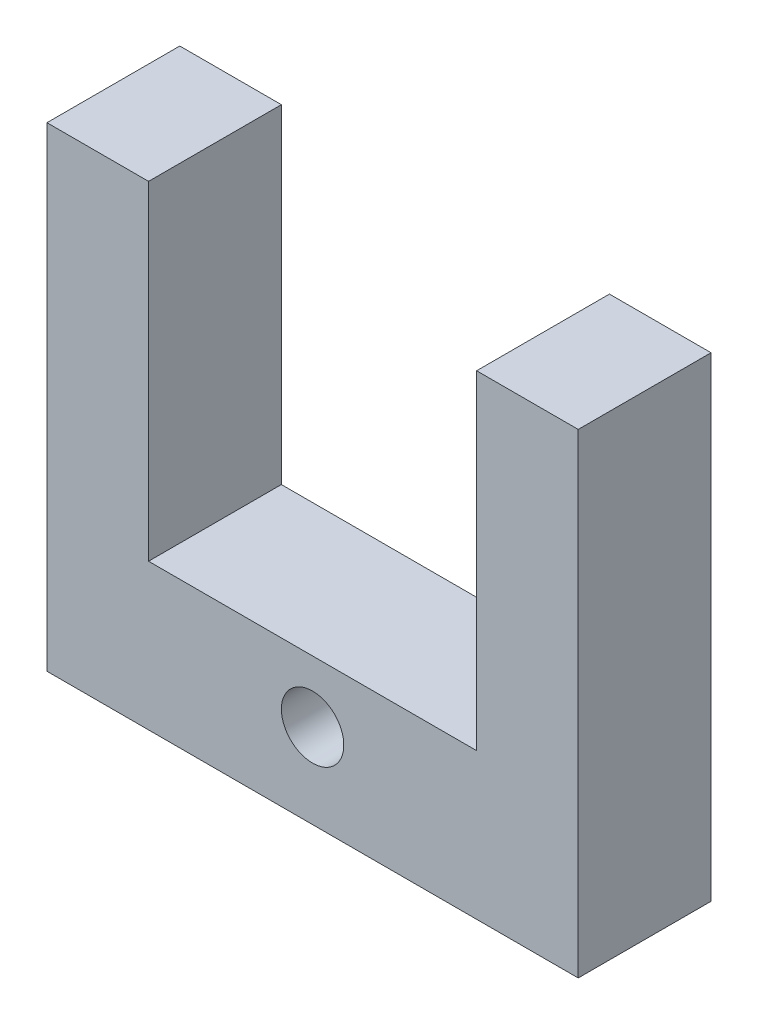
ISO-10303-21;
HEADER;
FILE_DESCRIPTION(('STEP AP214'),'2;1');
FILE_NAME('part.step','',(''),(''),'','','');
FILE_SCHEMA(('AUTOMOTIVE_DESIGN { 1 0 10303 214 1 1 1 1 }'));
ENDSEC;
DATA;
#1=APPLICATION_CONTEXT('core data for automotive mechanical design processes');
#2=APPLICATION_PROTOCOL_DEFINITION('international standard','automotive_design',2000,#1);
#3=PRODUCT_CONTEXT('',#1,'mechanical');
#4=PRODUCT('Part','Part','',(#3));
#5=PRODUCT_RELATED_PRODUCT_CATEGORY('part','',(#4));
#6=PRODUCT_DEFINITION_FORMATION('','',#4);
#7=PRODUCT_DEFINITION_CONTEXT('part definition',#1,'design');
#8=PRODUCT_DEFINITION('design','',#6,#7);
#9=PRODUCT_DEFINITION_SHAPE('','',#8);
#10=(LENGTH_UNIT() NAMED_UNIT(*) SI_UNIT(.MILLI.,.METRE.));
#11=(NAMED_UNIT(*) PLANE_ANGLE_UNIT() SI_UNIT($,.RADIAN.));
#12=(NAMED_UNIT(*) SI_UNIT($,.STERADIAN.) SOLID_ANGLE_UNIT());
#13=UNCERTAINTY_MEASURE_WITH_UNIT(LENGTH_MEASURE(1.E-05),#10,'distance_accuracy_value','');
#14=(GEOMETRIC_REPRESENTATION_CONTEXT(3) GLOBAL_UNCERTAINTY_ASSIGNED_CONTEXT((#13)) GLOBAL_UNIT_ASSIGNED_CONTEXT((#10,
#11,#12)) REPRESENTATION_CONTEXT('',''));
#15=CARTESIAN_POINT('',(0.,0.,0.));
#16=DIRECTION('',(0.,0.,1.));
#17=DIRECTION('',(1.,0.,0.));
#18=AXIS2_PLACEMENT_3D('',#15,#16,#17);
#19=CARTESIAN_POINT('',(9.99999999999999,35.,5.));
#20=DIRECTION('',(-1.,0.,0.));
#21=DIRECTION('',(0.,-1.,0.));
#22=AXIS2_PLACEMENT_3D('',#19,#20,#21);
#23=PLANE('',#22);
#24=DIRECTION('',(0.,1.,0.));
#25=VECTOR('',#24,1.);
#26=CARTESIAN_POINT('',(9.99999999999999,35.,0.));
#27=LINE('',#26,#25);
#28=CARTESIAN_POINT('',(10.,-35.,0.));
#29=VERTEX_POINT('',#28);
#30=CARTESIAN_POINT('',(10.,-17.1146771652388,0.));
#31=VERTEX_POINT('',#30);
#32=EDGE_CURVE('E141',#29,#31,#27,.T.);
#33=ORIENTED_EDGE('',*,*,#32,.T.);
#34=DIRECTION('',(0.,0.,1.));
#35=VECTOR('',#34,1.);
#36=CARTESIAN_POINT('',(10.,-17.1146771652388,-5.));
#37=LINE('',#36,#35);
#38=CARTESIAN_POINT('',(10.,-17.1146771652388,5.));
#39=VERTEX_POINT('',#38);
#40=EDGE_CURVE('E166',#31,#39,#37,.T.);
#41=ORIENTED_EDGE('',*,*,#40,.T.);
#42=DIRECTION('',(0.,1.,0.));
#43=VECTOR('',#42,1.);
#44=CARTESIAN_POINT('',(9.99999999999999,35.,5.));
#45=LINE('',#44,#43);
#46=CARTESIAN_POINT('',(10.,-35.,5.));
#47=VERTEX_POINT('',#46);
#48=EDGE_CURVE('E133',#47,#39,#45,.T.);
#49=ORIENTED_EDGE('',*,*,#48,.F.);
#50=DIRECTION('',(0.,0.,-1.));
#51=VECTOR('',#50,1.);
#52=CARTESIAN_POINT('',(10.,-35.,5.));
#53=LINE('',#52,#51);
#54=EDGE_CURVE('E55',#47,#29,#53,.T.);
#55=ORIENTED_EDGE('',*,*,#54,.T.);
#56=EDGE_LOOP('',(#33,#41,#49,#55));
#57=FACE_BOUND('',#56,.T.);
#58=ADVANCED_FACE('F48',(#57),#23,.F.);
#59=CARTESIAN_POINT('',(-10.,35.,5.));
#60=DIRECTION('',(1.,0.,0.));
#61=DIRECTION('',(0.,1.,0.));
#62=AXIS2_PLACEMENT_3D('',#59,#60,#61);
#63=PLANE('',#62);
#64=DIRECTION('',(0.,-1.,0.));
#65=VECTOR('',#64,1.);
#66=CARTESIAN_POINT('',(-10.,35.,5.));
#67=LINE('',#66,#65);
#68=CARTESIAN_POINT('',(-10.,-17.1146771652388,5.));
#69=VERTEX_POINT('',#68);
#70=CARTESIAN_POINT('',(-10.,-35.,5.));
#71=VERTEX_POINT('',#70);
#72=EDGE_CURVE('E125',#69,#71,#67,.T.);
#73=ORIENTED_EDGE('',*,*,#72,.F.);
#74=DIRECTION('',(0.,0.,1.));
#75=VECTOR('',#74,1.);
#76=CARTESIAN_POINT('',(-10.,-17.1146771652388,-5.));
#77=LINE('',#76,#75);
#78=CARTESIAN_POINT('',(-10.,-17.1146771652388,0.));
#79=VERTEX_POINT('',#78);
#80=EDGE_CURVE('E110',#79,#69,#77,.T.);
#81=ORIENTED_EDGE('',*,*,#80,.F.);
#82=DIRECTION('',(0.,-1.,0.));
#83=VECTOR('',#82,1.);
#84=CARTESIAN_POINT('',(-10.,35.,0.));
#85=LINE('',#84,#83);
#86=CARTESIAN_POINT('',(-10.,-35.,0.));
#87=VERTEX_POINT('',#86);
#88=EDGE_CURVE('E144',#79,#87,#85,.T.);
#89=ORIENTED_EDGE('',*,*,#88,.T.);
#90=DIRECTION('',(0.,0.,-1.));
#91=VECTOR('',#90,1.);
#92=CARTESIAN_POINT('',(-10.,-35.,5.));
#93=LINE('',#92,#91);
#94=EDGE_CURVE('E12',#71,#87,#93,.T.);
#95=ORIENTED_EDGE('',*,*,#94,.F.);
#96=EDGE_LOOP('',(#73,#81,#89,#95));
#97=FACE_BOUND('',#96,.T.);
#98=ADVANCED_FACE('F130',(#97),#63,.F.);
#99=CARTESIAN_POINT('',(-10.,-35.,5.));
#100=DIRECTION('',(0.,1.,0.));
#101=DIRECTION('',(0.,0.,1.));
#102=AXIS2_PLACEMENT_3D('',#99,#100,#101);
#103=PLANE('',#102);
#104=DIRECTION('',(1.,0.,0.));
#105=VECTOR('',#104,1.);
#106=CARTESIAN_POINT('',(-10.,-35.,0.));
#107=LINE('',#106,#105);
#108=EDGE_CURVE('E137',#87,#29,#107,.T.);
#109=ORIENTED_EDGE('',*,*,#108,.T.);
#110=ORIENTED_EDGE('',*,*,#54,.F.);
#111=DIRECTION('',(1.,0.,0.));
#112=VECTOR('',#111,1.);
#113=CARTESIAN_POINT('',(-10.,-35.,5.));
#114=LINE('',#113,#112);
#115=EDGE_CURVE('E132',#71,#47,#114,.T.);
#116=ORIENTED_EDGE('',*,*,#115,.F.);
#117=ORIENTED_EDGE('',*,*,#94,.T.);
#118=EDGE_LOOP('',(#109,#110,#116,#117));
#119=FACE_BOUND('',#118,.T.);
#120=ADVANCED_FACE('F199',(#119),#103,.F.);
#121=CARTESIAN_POINT('',(0.,0.,5.));
#122=DIRECTION('',(0.,0.,1.));
#123=DIRECTION('',(1.,0.,0.));
#124=AXIS2_PLACEMENT_3D('',#121,#122,#123);
#125=PLANE('',#124);
#126=DIRECTION('',(1.,0.,0.));
#127=VECTOR('',#126,1.);
#128=CARTESIAN_POINT('',(0.,-17.1146771652388,5.));
#129=LINE('',#128,#127);
#130=CARTESIAN_POINT('',(6.175,-17.1146771652388,5.));
#131=VERTEX_POINT('',#130);
#132=EDGE_CURVE('E118',#131,#39,#129,.T.);
#133=ORIENTED_EDGE('',*,*,#132,.F.);
#134=DIRECTION('',(0.,1.,0.));
#135=VECTOR('',#134,1.);
#136=CARTESIAN_POINT('',(6.175,-6.49999999999998,5.));
#137=LINE('',#136,#135);
#138=CARTESIAN_POINT('',(6.175,-29.5,5.));
#139=VERTEX_POINT('',#138);
#140=EDGE_CURVE('E170',#139,#131,#137,.T.);
#141=ORIENTED_EDGE('',*,*,#140,.F.);
#142=DIRECTION('',(1.,0.,0.));
#143=VECTOR('',#142,1.);
#144=CARTESIAN_POINT('',(-6.175,-29.5,5.));
#145=LINE('',#144,#143);
#146=CARTESIAN_POINT('',(-6.175,-29.5,5.));
#147=VERTEX_POINT('',#146);
#148=EDGE_CURVE('E174',#147,#139,#145,.T.);
#149=ORIENTED_EDGE('',*,*,#148,.F.);
#150=DIRECTION('',(0.,-1.,0.));
#151=VECTOR('',#150,1.);
#152=CARTESIAN_POINT('',(-6.175,-6.49999999999998,5.));
#153=LINE('',#152,#151);
#154=CARTESIAN_POINT('',(-6.175,-17.1146771652388,5.));
#155=VERTEX_POINT('',#154);
#156=EDGE_CURVE('E128',#155,#147,#153,.T.);
#157=ORIENTED_EDGE('',*,*,#156,.F.);
#158=EDGE_CURVE('E70',#69,#155,#129,.T.);
#159=ORIENTED_EDGE('',*,*,#158,.F.);
#160=ORIENTED_EDGE('',*,*,#72,.T.);
#161=ORIENTED_EDGE('',*,*,#115,.T.);
#162=ORIENTED_EDGE('',*,*,#48,.T.);
#163=EDGE_LOOP('',(#133,#141,#149,#157,#159,#160,#161,#162));
#164=FACE_BOUND('',#163,.T.);
#165=CARTESIAN_POINT('',(0.,-31.82,5.));
#166=DIRECTION('',(0.,0.,1.));
#167=DIRECTION('',(-1.,0.,0.));
#168=AXIS2_PLACEMENT_3D('',#165,#166,#167);
#169=CIRCLE('',#168,1.175);
#170=CARTESIAN_POINT('',(-1.175,-31.82,5.));
#171=VERTEX_POINT('',#170);
#172=EDGE_CURVE('E161',#171,#171,#169,.T.);
#173=ORIENTED_EDGE('',*,*,#172,.F.);
#174=EDGE_LOOP('',(#173));
#175=FACE_BOUND('',#174,.T.);
#176=ADVANCED_FACE('F123',(#164,#175),#125,.T.);
#177=CARTESIAN_POINT('',(0.,0.,0.));
#178=DIRECTION('',(0.,0.,1.));
#179=DIRECTION('',(1.,0.,0.));
#180=AXIS2_PLACEMENT_3D('',#177,#178,#179);
#181=PLANE('',#180);
#182=CARTESIAN_POINT('',(0.,-31.82,0.));
#183=DIRECTION('',(0.,0.,1.));
#184=DIRECTION('',(-1.,0.,0.));
#185=AXIS2_PLACEMENT_3D('',#182,#183,#184);
#186=CIRCLE('',#185,1.175);
#187=CARTESIAN_POINT('',(-1.175,-31.82,0.));
#188=VERTEX_POINT('',#187);
#189=EDGE_CURVE('E164',#188,#188,#186,.T.);
#190=ORIENTED_EDGE('',*,*,#189,.T.);
#191=EDGE_LOOP('',(#190));
#192=FACE_BOUND('',#191,.T.);
#193=DIRECTION('',(0.,1.,0.));
#194=VECTOR('',#193,1.);
#195=CARTESIAN_POINT('',(6.175,-6.49999999999998,0.));
#196=LINE('',#195,#194);
#197=CARTESIAN_POINT('',(6.175,-29.5,0.));
#198=VERTEX_POINT('',#197);
#199=CARTESIAN_POINT('',(6.175,-17.1146771652388,0.));
#200=VERTEX_POINT('',#199);
#201=EDGE_CURVE('E160',#198,#200,#196,.T.);
#202=ORIENTED_EDGE('',*,*,#201,.T.);
#203=DIRECTION('',(1.,0.,0.));
#204=VECTOR('',#203,1.);
#205=CARTESIAN_POINT('',(0.,-17.1146771652388,0.));
#206=LINE('',#205,#204);
#207=EDGE_CURVE('E62',#200,#31,#206,.T.);
#208=ORIENTED_EDGE('',*,*,#207,.T.);
#209=ORIENTED_EDGE('',*,*,#32,.F.);
#210=ORIENTED_EDGE('',*,*,#108,.F.);
#211=ORIENTED_EDGE('',*,*,#88,.F.);
#212=DIRECTION('',(1.,0.,0.));
#213=VECTOR('',#212,1.);
#214=CARTESIAN_POINT('',(0.,-17.1146771652388,0.));
#215=LINE('',#214,#213);
#216=CARTESIAN_POINT('',(-6.175,-17.1146771652388,0.));
#217=VERTEX_POINT('',#216);
#218=EDGE_CURVE('E113',#79,#217,#215,.T.);
#219=ORIENTED_EDGE('',*,*,#218,.T.);
#220=DIRECTION('',(0.,-1.,0.));
#221=VECTOR('',#220,1.);
#222=CARTESIAN_POINT('',(-6.175,-6.49999999999998,0.));
#223=LINE('',#222,#221);
#224=CARTESIAN_POINT('',(-6.175,-29.5,0.));
#225=VERTEX_POINT('',#224);
#226=EDGE_CURVE('E173',#217,#225,#223,.T.);
#227=ORIENTED_EDGE('',*,*,#226,.T.);
#228=DIRECTION('',(1.,0.,0.));
#229=VECTOR('',#228,1.);
#230=CARTESIAN_POINT('',(-6.175,-29.5,0.));
#231=LINE('',#230,#229);
#232=EDGE_CURVE('E176',#225,#198,#231,.T.);
#233=ORIENTED_EDGE('',*,*,#232,.T.);
#234=EDGE_LOOP('',(#202,#208,#209,#210,#211,#219,#227,#233));
#235=FACE_BOUND('',#234,.T.);
#236=ADVANCED_FACE('F157',(#192,#235),#181,.F.);
#237=CARTESIAN_POINT('',(6.175,-6.49999999999998,0.));
#238=DIRECTION('',(1.,0.,0.));
#239=DIRECTION('',(0.,1.,0.));
#240=AXIS2_PLACEMENT_3D('',#237,#238,#239);
#241=PLANE('',#240);
#242=ORIENTED_EDGE('',*,*,#140,.T.);
#243=DIRECTION('',(0.,0.,1.));
#244=VECTOR('',#243,1.);
#245=CARTESIAN_POINT('',(6.175,-17.1146771652388,-5.));
#246=LINE('',#245,#244);
#247=EDGE_CURVE('E194',#200,#131,#246,.T.);
#248=ORIENTED_EDGE('',*,*,#247,.F.);
#249=ORIENTED_EDGE('',*,*,#201,.F.);
#250=DIRECTION('',(0.,0.,1.));
#251=VECTOR('',#250,1.);
#252=CARTESIAN_POINT('',(6.175,-29.5,0.));
#253=LINE('',#252,#251);
#254=EDGE_CURVE('E145',#198,#139,#253,.T.);
#255=ORIENTED_EDGE('',*,*,#254,.T.);
#256=EDGE_LOOP('',(#242,#248,#249,#255));
#257=FACE_BOUND('',#256,.T.);
#258=ADVANCED_FACE('F193',(#257),#241,.F.);
#259=CARTESIAN_POINT('',(-6.175,-29.5,0.));
#260=DIRECTION('',(0.,-1.,0.));
#261=DIRECTION('',(0.,0.,-1.));
#262=AXIS2_PLACEMENT_3D('',#259,#260,#261);
#263=PLANE('',#262);
#264=ORIENTED_EDGE('',*,*,#148,.T.);
#265=ORIENTED_EDGE('',*,*,#254,.F.);
#266=ORIENTED_EDGE('',*,*,#232,.F.);
#267=DIRECTION('',(0.,0.,1.));
#268=VECTOR('',#267,1.);
#269=CARTESIAN_POINT('',(-6.175,-29.5,0.));
#270=LINE('',#269,#268);
#271=EDGE_CURVE('E178',#225,#147,#270,.T.);
#272=ORIENTED_EDGE('',*,*,#271,.T.);
#273=EDGE_LOOP('',(#264,#265,#266,#272));
#274=FACE_BOUND('',#273,.T.);
#275=ADVANCED_FACE('F188',(#274),#263,.F.);
#276=CARTESIAN_POINT('',(-6.175,-6.49999999999998,0.));
#277=DIRECTION('',(-1.,0.,0.));
#278=DIRECTION('',(0.,-1.,0.));
#279=AXIS2_PLACEMENT_3D('',#276,#277,#278);
#280=PLANE('',#279);
#281=ORIENTED_EDGE('',*,*,#226,.F.);
#282=DIRECTION('',(0.,0.,1.));
#283=VECTOR('',#282,1.);
#284=CARTESIAN_POINT('',(-6.175,-17.1146771652388,-5.));
#285=LINE('',#284,#283);
#286=EDGE_CURVE('E117',#217,#155,#285,.T.);
#287=ORIENTED_EDGE('',*,*,#286,.T.);
#288=ORIENTED_EDGE('',*,*,#156,.T.);
#289=ORIENTED_EDGE('',*,*,#271,.F.);
#290=EDGE_LOOP('',(#281,#287,#288,#289));
#291=FACE_BOUND('',#290,.T.);
#292=ADVANCED_FACE('F195',(#291),#280,.F.);
#293=CARTESIAN_POINT('',(0.,-31.82,0.));
#294=DIRECTION('',(0.,0.,1.));
#295=DIRECTION('',(1.,0.,0.));
#296=AXIS2_PLACEMENT_3D('',#293,#294,#295);
#297=CYLINDRICAL_SURFACE('',#296,1.175);
#298=ORIENTED_EDGE('',*,*,#189,.F.);
#299=EDGE_LOOP('',(#298));
#300=FACE_BOUND('',#299,.T.);
#301=ORIENTED_EDGE('',*,*,#172,.T.);
#302=EDGE_LOOP('',(#301));
#303=FACE_BOUND('',#302,.T.);
#304=ADVANCED_FACE('F250',(#300,#303),#297,.F.);
#305=CARTESIAN_POINT('',(0.,-17.1146771652388,-5.));
#306=DIRECTION('',(0.,-1.,0.));
#307=DIRECTION('',(0.,0.,-1.));
#308=AXIS2_PLACEMENT_3D('',#305,#306,#307);
#309=PLANE('',#308);
#310=ORIENTED_EDGE('',*,*,#80,.T.);
#311=ORIENTED_EDGE('',*,*,#158,.T.);
#312=ORIENTED_EDGE('',*,*,#286,.F.);
#313=ORIENTED_EDGE('',*,*,#218,.F.);
#314=EDGE_LOOP('',(#310,#311,#312,#313));
#315=FACE_BOUND('',#314,.T.);
#316=ADVANCED_FACE('F111',(#315),#309,.F.);
#317=ORIENTED_EDGE('',*,*,#247,.T.);
#318=ORIENTED_EDGE('',*,*,#132,.T.);
#319=ORIENTED_EDGE('',*,*,#40,.F.);
#320=ORIENTED_EDGE('',*,*,#207,.F.);
#321=EDGE_LOOP('',(#317,#318,#319,#320));
#322=FACE_BOUND('',#321,.T.);
#323=ADVANCED_FACE('F261',(#322),#309,.F.);
#324=CLOSED_SHELL('',(#58,#98,#120,#176,#236,#258,#275,#292,#304,#316,#323));
#325=MANIFOLD_SOLID_BREP('B2',#324);
#326=ADVANCED_BREP_SHAPE_REPRESENTATION('',(#18,#325),#14);
#327=SHAPE_DEFINITION_REPRESENTATION(#9,#326);
ENDSEC;
END-ISO-10303-21;
